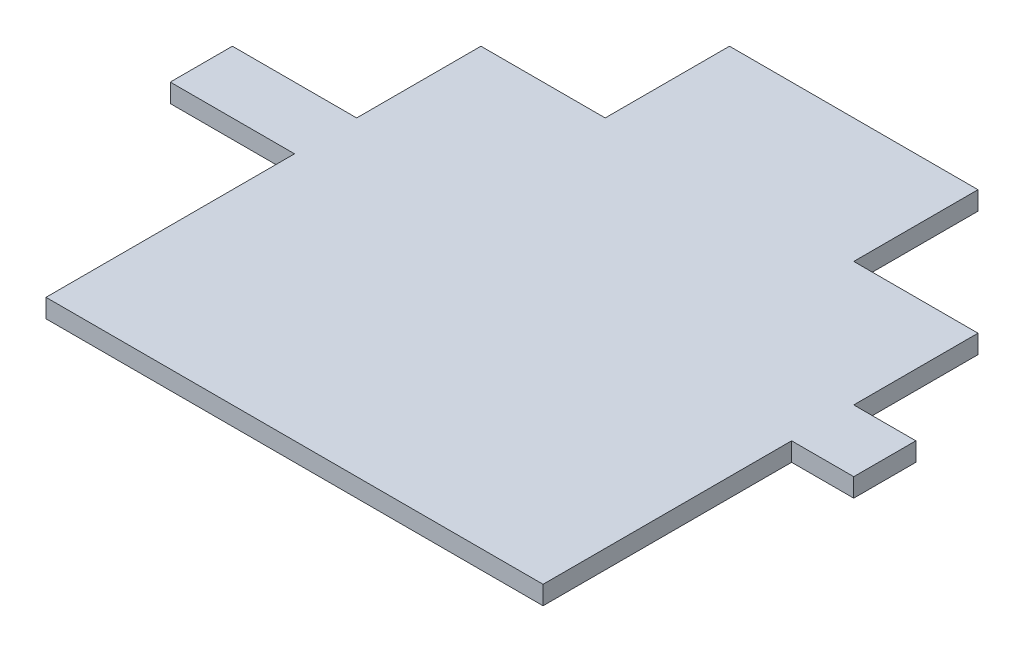
ISO-10303-21;
HEADER;
FILE_DESCRIPTION(('STEP AP214'),'2;1');
FILE_NAME('part.step','',(''),(''),'','','');
FILE_SCHEMA(('AUTOMOTIVE_DESIGN { 1 0 10303 214 1 1 1 1 }'));
ENDSEC;
DATA;
#1=APPLICATION_CONTEXT('core data for automotive mechanical design processes');
#2=APPLICATION_PROTOCOL_DEFINITION('international standard','automotive_design',2000,#1);
#3=PRODUCT_CONTEXT('',#1,'mechanical');
#4=PRODUCT('Part','Part','',(#3));
#5=PRODUCT_RELATED_PRODUCT_CATEGORY('part','',(#4));
#6=PRODUCT_DEFINITION_FORMATION('','',#4);
#7=PRODUCT_DEFINITION_CONTEXT('part definition',#1,'design');
#8=PRODUCT_DEFINITION('design','',#6,#7);
#9=PRODUCT_DEFINITION_SHAPE('','',#8);
#10=(LENGTH_UNIT() NAMED_UNIT(*) SI_UNIT(.MILLI.,.METRE.));
#11=(NAMED_UNIT(*) PLANE_ANGLE_UNIT() SI_UNIT($,.RADIAN.));
#12=(NAMED_UNIT(*) SI_UNIT($,.STERADIAN.) SOLID_ANGLE_UNIT());
#13=UNCERTAINTY_MEASURE_WITH_UNIT(LENGTH_MEASURE(1.E-05),#10,'distance_accuracy_value','');
#14=(GEOMETRIC_REPRESENTATION_CONTEXT(3) GLOBAL_UNCERTAINTY_ASSIGNED_CONTEXT((#13)) GLOBAL_UNIT_ASSIGNED_CONTEXT((#10,
#11,#12)) REPRESENTATION_CONTEXT('',''));
#15=CARTESIAN_POINT('',(0.,0.,0.));
#16=DIRECTION('',(0.,0.,1.));
#17=DIRECTION('',(1.,0.,0.));
#18=AXIS2_PLACEMENT_3D('',#15,#16,#17);
#19=CARTESIAN_POINT('',(-18.5650444594796,3.,12.794760036702));
#20=DIRECTION('',(1.,0.,0.));
#21=DIRECTION('',(0.,0.,-1.));
#22=AXIS2_PLACEMENT_3D('',#19,#20,#21);
#23=PLANE('',#22);
#24=DIRECTION('',(0.,0.,1.));
#25=VECTOR('',#24,1.);
#26=CARTESIAN_POINT('',(-18.5650444594796,0.,12.794760036702));
#27=LINE('',#26,#25);
#28=CARTESIAN_POINT('',(-18.5650444594796,0.,-7.20523996329803));
#29=VERTEX_POINT('',#28);
#30=CARTESIAN_POINT('',(-18.5650444594796,0.,12.794760036702));
#31=VERTEX_POINT('',#30);
#32=EDGE_CURVE('E177',#29,#31,#27,.T.);
#33=ORIENTED_EDGE('',*,*,#32,.T.);
#34=DIRECTION('',(0.,-1.,0.));
#35=VECTOR('',#34,1.);
#36=CARTESIAN_POINT('',(-18.5650444594796,3.,12.794760036702));
#37=LINE('',#36,#35);
#38=CARTESIAN_POINT('',(-18.5650444594796,3.,12.794760036702));
#39=VERTEX_POINT('',#38);
#40=EDGE_CURVE('E11',#39,#31,#37,.T.);
#41=ORIENTED_EDGE('',*,*,#40,.F.);
#42=DIRECTION('',(0.,0.,1.));
#43=VECTOR('',#42,1.);
#44=CARTESIAN_POINT('',(-18.5650444594796,3.,12.794760036702));
#45=LINE('',#44,#43);
#46=CARTESIAN_POINT('',(-18.5650444594796,3.,-7.20523996329803));
#47=VERTEX_POINT('',#46);
#48=EDGE_CURVE('E207',#47,#39,#45,.T.);
#49=ORIENTED_EDGE('',*,*,#48,.F.);
#50=DIRECTION('',(0.,-1.,0.));
#51=VECTOR('',#50,1.);
#52=CARTESIAN_POINT('',(-18.5650444594796,3.,-7.20523996329803));
#53=LINE('',#52,#51);
#54=EDGE_CURVE('E173',#47,#29,#53,.T.);
#55=ORIENTED_EDGE('',*,*,#54,.T.);
#56=EDGE_LOOP('',(#33,#41,#49,#55));
#57=FACE_BOUND('',#56,.T.);
#58=ADVANCED_FACE('F33',(#57),#23,.F.);
#59=CARTESIAN_POINT('',(-38.5650444594796,3.,12.794760036702));
#60=DIRECTION('',(0.,0.,1.));
#61=DIRECTION('',(1.,0.,0.));
#62=AXIS2_PLACEMENT_3D('',#59,#60,#61);
#63=PLANE('',#62);
#64=DIRECTION('',(-1.,0.,0.));
#65=VECTOR('',#64,1.);
#66=CARTESIAN_POINT('',(-38.5650444594796,0.,12.794760036702));
#67=LINE('',#66,#65);
#68=CARTESIAN_POINT('',(-38.5650444594796,0.,12.794760036702));
#69=VERTEX_POINT('',#68);
#70=EDGE_CURVE('E180',#31,#69,#67,.T.);
#71=ORIENTED_EDGE('',*,*,#70,.T.);
#72=DIRECTION('',(0.,-1.,0.));
#73=VECTOR('',#72,1.);
#74=CARTESIAN_POINT('',(-38.5650444594796,3.,12.794760036702));
#75=LINE('',#74,#73);
#76=CARTESIAN_POINT('',(-38.5650444594796,3.,12.794760036702));
#77=VERTEX_POINT('',#76);
#78=EDGE_CURVE('E41',#77,#69,#75,.T.);
#79=ORIENTED_EDGE('',*,*,#78,.F.);
#80=DIRECTION('',(-1.,0.,0.));
#81=VECTOR('',#80,1.);
#82=CARTESIAN_POINT('',(-38.5650444594796,3.,12.794760036702));
#83=LINE('',#82,#81);
#84=EDGE_CURVE('E116',#39,#77,#83,.T.);
#85=ORIENTED_EDGE('',*,*,#84,.F.);
#86=ORIENTED_EDGE('',*,*,#40,.T.);
#87=EDGE_LOOP('',(#71,#79,#85,#86));
#88=FACE_BOUND('',#87,.T.);
#89=ADVANCED_FACE('F305',(#88),#63,.F.);
#90=CARTESIAN_POINT('',(-38.5650444594796,3.,12.794760036702));
#91=DIRECTION('',(1.,0.,0.));
#92=DIRECTION('',(0.,0.,-1.));
#93=AXIS2_PLACEMENT_3D('',#90,#91,#92);
#94=PLANE('',#93);
#95=DIRECTION('',(0.,0.,1.));
#96=VECTOR('',#95,1.);
#97=CARTESIAN_POINT('',(-38.5650444594796,0.,12.794760036702));
#98=LINE('',#97,#96);
#99=CARTESIAN_POINT('',(-38.5650444594796,0.,32.794760036702));
#100=VERTEX_POINT('',#99);
#101=EDGE_CURVE('E182',#69,#100,#98,.T.);
#102=ORIENTED_EDGE('',*,*,#101,.T.);
#103=DIRECTION('',(0.,-1.,0.));
#104=VECTOR('',#103,1.);
#105=CARTESIAN_POINT('',(-38.5650444594796,3.,32.794760036702));
#106=LINE('',#105,#104);
#107=CARTESIAN_POINT('',(-38.5650444594796,3.,32.794760036702));
#108=VERTEX_POINT('',#107);
#109=EDGE_CURVE('E238',#108,#100,#106,.T.);
#110=ORIENTED_EDGE('',*,*,#109,.F.);
#111=DIRECTION('',(0.,0.,1.));
#112=VECTOR('',#111,1.);
#113=CARTESIAN_POINT('',(-38.5650444594796,3.,12.794760036702));
#114=LINE('',#113,#112);
#115=EDGE_CURVE('E246',#77,#108,#114,.T.);
#116=ORIENTED_EDGE('',*,*,#115,.F.);
#117=ORIENTED_EDGE('',*,*,#78,.T.);
#118=EDGE_LOOP('',(#102,#110,#116,#117));
#119=FACE_BOUND('',#118,.T.);
#120=ADVANCED_FACE('F244',(#119),#94,.F.);
#121=CARTESIAN_POINT('',(-38.5650444594796,3.,32.794760036702));
#122=DIRECTION('',(0.,0.,1.));
#123=DIRECTION('',(1.,0.,0.));
#124=AXIS2_PLACEMENT_3D('',#121,#122,#123);
#125=PLANE('',#124);
#126=DIRECTION('',(-1.,0.,0.));
#127=VECTOR('',#126,1.);
#128=CARTESIAN_POINT('',(-38.5650444594796,0.,32.794760036702));
#129=LINE('',#128,#127);
#130=CARTESIAN_POINT('',(-58.5650444594796,0.,32.794760036702));
#131=VERTEX_POINT('',#130);
#132=EDGE_CURVE('E184',#100,#131,#129,.T.);
#133=ORIENTED_EDGE('',*,*,#132,.T.);
#134=DIRECTION('',(0.,-1.,0.));
#135=VECTOR('',#134,1.);
#136=CARTESIAN_POINT('',(-58.5650444594796,3.,32.794760036702));
#137=LINE('',#136,#135);
#138=CARTESIAN_POINT('',(-58.5650444594796,3.,32.794760036702));
#139=VERTEX_POINT('',#138);
#140=EDGE_CURVE('E235',#139,#131,#137,.T.);
#141=ORIENTED_EDGE('',*,*,#140,.F.);
#142=DIRECTION('',(-1.,0.,0.));
#143=VECTOR('',#142,1.);
#144=CARTESIAN_POINT('',(-38.5650444594796,3.,32.794760036702));
#145=LINE('',#144,#143);
#146=EDGE_CURVE('E264',#108,#139,#145,.T.);
#147=ORIENTED_EDGE('',*,*,#146,.F.);
#148=ORIENTED_EDGE('',*,*,#109,.T.);
#149=EDGE_LOOP('',(#133,#141,#147,#148));
#150=FACE_BOUND('',#149,.T.);
#151=ADVANCED_FACE('F255',(#150),#125,.F.);
#152=CARTESIAN_POINT('',(-58.5650444594796,3.,32.794760036702));
#153=DIRECTION('',(1.,0.,0.));
#154=DIRECTION('',(0.,0.,-1.));
#155=AXIS2_PLACEMENT_3D('',#152,#153,#154);
#156=PLANE('',#155);
#157=DIRECTION('',(0.,0.,1.));
#158=VECTOR('',#157,1.);
#159=CARTESIAN_POINT('',(-58.5650444594796,0.,32.794760036702));
#160=LINE('',#159,#158);
#161=CARTESIAN_POINT('',(-58.5650444594796,0.,42.794760036702));
#162=VERTEX_POINT('',#161);
#163=EDGE_CURVE('E186',#131,#162,#160,.T.);
#164=ORIENTED_EDGE('',*,*,#163,.T.);
#165=DIRECTION('',(0.,-1.,0.));
#166=VECTOR('',#165,1.);
#167=CARTESIAN_POINT('',(-58.5650444594796,3.,42.794760036702));
#168=LINE('',#167,#166);
#169=CARTESIAN_POINT('',(-58.5650444594796,3.,42.794760036702));
#170=VERTEX_POINT('',#169);
#171=EDGE_CURVE('E232',#170,#162,#168,.T.);
#172=ORIENTED_EDGE('',*,*,#171,.F.);
#173=DIRECTION('',(0.,0.,1.));
#174=VECTOR('',#173,1.);
#175=CARTESIAN_POINT('',(-58.5650444594796,3.,32.794760036702));
#176=LINE('',#175,#174);
#177=EDGE_CURVE('E261',#139,#170,#176,.T.);
#178=ORIENTED_EDGE('',*,*,#177,.F.);
#179=ORIENTED_EDGE('',*,*,#140,.T.);
#180=EDGE_LOOP('',(#164,#172,#178,#179));
#181=FACE_BOUND('',#180,.T.);
#182=ADVANCED_FACE('F259',(#181),#156,.F.);
#183=CARTESIAN_POINT('',(-38.5650444594796,3.,42.794760036702));
#184=DIRECTION('',(0.,0.,-1.));
#185=DIRECTION('',(-1.,0.,0.));
#186=AXIS2_PLACEMENT_3D('',#183,#184,#185);
#187=PLANE('',#186);
#188=DIRECTION('',(1.,0.,0.));
#189=VECTOR('',#188,1.);
#190=CARTESIAN_POINT('',(-38.5650444594796,0.,42.794760036702));
#191=LINE('',#190,#189);
#192=CARTESIAN_POINT('',(-38.5650444594796,0.,42.794760036702));
#193=VERTEX_POINT('',#192);
#194=EDGE_CURVE('E188',#162,#193,#191,.T.);
#195=ORIENTED_EDGE('',*,*,#194,.T.);
#196=DIRECTION('',(0.,-1.,0.));
#197=VECTOR('',#196,1.);
#198=CARTESIAN_POINT('',(-38.5650444594796,3.,42.794760036702));
#199=LINE('',#198,#197);
#200=CARTESIAN_POINT('',(-38.5650444594796,3.,42.794760036702));
#201=VERTEX_POINT('',#200);
#202=EDGE_CURVE('E229',#201,#193,#199,.T.);
#203=ORIENTED_EDGE('',*,*,#202,.F.);
#204=DIRECTION('',(1.,0.,0.));
#205=VECTOR('',#204,1.);
#206=CARTESIAN_POINT('',(-38.5650444594796,3.,42.794760036702));
#207=LINE('',#206,#205);
#208=EDGE_CURVE('E263',#170,#201,#207,.T.);
#209=ORIENTED_EDGE('',*,*,#208,.F.);
#210=ORIENTED_EDGE('',*,*,#171,.T.);
#211=EDGE_LOOP('',(#195,#203,#209,#210));
#212=FACE_BOUND('',#211,.T.);
#213=ADVANCED_FACE('F318',(#212),#187,.F.);
#214=CARTESIAN_POINT('',(-38.5650444594796,3.,42.794760036702));
#215=DIRECTION('',(1.,0.,0.));
#216=DIRECTION('',(0.,0.,-1.));
#217=AXIS2_PLACEMENT_3D('',#214,#215,#216);
#218=PLANE('',#217);
#219=DIRECTION('',(0.,0.,1.));
#220=VECTOR('',#219,1.);
#221=CARTESIAN_POINT('',(-38.5650444594796,0.,42.794760036702));
#222=LINE('',#221,#220);
#223=CARTESIAN_POINT('',(-38.5650444594796,0.,82.794760036702));
#224=VERTEX_POINT('',#223);
#225=EDGE_CURVE('E190',#193,#224,#222,.T.);
#226=ORIENTED_EDGE('',*,*,#225,.T.);
#227=DIRECTION('',(0.,-1.,0.));
#228=VECTOR('',#227,1.);
#229=CARTESIAN_POINT('',(-38.5650444594796,3.,82.794760036702));
#230=LINE('',#229,#228);
#231=CARTESIAN_POINT('',(-38.5650444594796,3.,82.794760036702));
#232=VERTEX_POINT('',#231);
#233=EDGE_CURVE('E226',#232,#224,#230,.T.);
#234=ORIENTED_EDGE('',*,*,#233,.F.);
#235=DIRECTION('',(0.,0.,1.));
#236=VECTOR('',#235,1.);
#237=CARTESIAN_POINT('',(-38.5650444594796,3.,42.794760036702));
#238=LINE('',#237,#236);
#239=EDGE_CURVE('E266',#201,#232,#238,.T.);
#240=ORIENTED_EDGE('',*,*,#239,.F.);
#241=ORIENTED_EDGE('',*,*,#202,.T.);
#242=EDGE_LOOP('',(#226,#234,#240,#241));
#243=FACE_BOUND('',#242,.T.);
#244=ADVANCED_FACE('F321',(#243),#218,.F.);
#245=CARTESIAN_POINT('',(-38.5650444594796,3.,82.794760036702));
#246=DIRECTION('',(0.,0.,-1.));
#247=DIRECTION('',(-1.,0.,0.));
#248=AXIS2_PLACEMENT_3D('',#245,#246,#247);
#249=PLANE('',#248);
#250=DIRECTION('',(1.,0.,0.));
#251=VECTOR('',#250,1.);
#252=CARTESIAN_POINT('',(-38.5650444594796,0.,82.794760036702));
#253=LINE('',#252,#251);
#254=CARTESIAN_POINT('',(41.4349555405204,0.,82.794760036702));
#255=VERTEX_POINT('',#254);
#256=EDGE_CURVE('E192',#224,#255,#253,.T.);
#257=ORIENTED_EDGE('',*,*,#256,.T.);
#258=DIRECTION('',(0.,-1.,0.));
#259=VECTOR('',#258,1.);
#260=CARTESIAN_POINT('',(41.4349555405204,3.,82.794760036702));
#261=LINE('',#260,#259);
#262=CARTESIAN_POINT('',(41.4349555405204,3.,82.794760036702));
#263=VERTEX_POINT('',#262);
#264=EDGE_CURVE('E223',#263,#255,#261,.T.);
#265=ORIENTED_EDGE('',*,*,#264,.F.);
#266=DIRECTION('',(1.,0.,0.));
#267=VECTOR('',#266,1.);
#268=CARTESIAN_POINT('',(-38.5650444594796,3.,82.794760036702));
#269=LINE('',#268,#267);
#270=EDGE_CURVE('E272',#232,#263,#269,.T.);
#271=ORIENTED_EDGE('',*,*,#270,.F.);
#272=ORIENTED_EDGE('',*,*,#233,.T.);
#273=EDGE_LOOP('',(#257,#265,#271,#272));
#274=FACE_BOUND('',#273,.T.);
#275=ADVANCED_FACE('F325',(#274),#249,.F.);
#276=CARTESIAN_POINT('',(41.4349555405204,3.,42.794760036702));
#277=DIRECTION('',(-1.,0.,0.));
#278=DIRECTION('',(0.,0.,1.));
#279=AXIS2_PLACEMENT_3D('',#276,#277,#278);
#280=PLANE('',#279);
#281=DIRECTION('',(0.,0.,-1.));
#282=VECTOR('',#281,1.);
#283=CARTESIAN_POINT('',(41.4349555405204,0.,42.794760036702));
#284=LINE('',#283,#282);
#285=CARTESIAN_POINT('',(41.4349555405204,0.,42.794760036702));
#286=VERTEX_POINT('',#285);
#287=EDGE_CURVE('E194',#255,#286,#284,.T.);
#288=ORIENTED_EDGE('',*,*,#287,.T.);
#289=DIRECTION('',(0.,-1.,0.));
#290=VECTOR('',#289,1.);
#291=CARTESIAN_POINT('',(41.4349555405204,3.,42.794760036702));
#292=LINE('',#291,#290);
#293=CARTESIAN_POINT('',(41.4349555405204,3.,42.794760036702));
#294=VERTEX_POINT('',#293);
#295=EDGE_CURVE('E220',#294,#286,#292,.T.);
#296=ORIENTED_EDGE('',*,*,#295,.F.);
#297=DIRECTION('',(0.,0.,-1.));
#298=VECTOR('',#297,1.);
#299=CARTESIAN_POINT('',(41.4349555405204,3.,42.794760036702));
#300=LINE('',#299,#298);
#301=EDGE_CURVE('E274',#263,#294,#300,.T.);
#302=ORIENTED_EDGE('',*,*,#301,.F.);
#303=ORIENTED_EDGE('',*,*,#264,.T.);
#304=EDGE_LOOP('',(#288,#296,#302,#303));
#305=FACE_BOUND('',#304,.T.);
#306=ADVANCED_FACE('F329',(#305),#280,.F.);
#307=CARTESIAN_POINT('',(41.4349555405204,3.,42.794760036702));
#308=DIRECTION('',(0.,0.,-1.));
#309=DIRECTION('',(-1.,0.,0.));
#310=AXIS2_PLACEMENT_3D('',#307,#308,#309);
#311=PLANE('',#310);
#312=DIRECTION('',(1.,0.,0.));
#313=VECTOR('',#312,1.);
#314=CARTESIAN_POINT('',(41.4349555405204,0.,42.794760036702));
#315=LINE('',#314,#313);
#316=CARTESIAN_POINT('',(51.4349555405204,0.,42.794760036702));
#317=VERTEX_POINT('',#316);
#318=EDGE_CURVE('E196',#286,#317,#315,.T.);
#319=ORIENTED_EDGE('',*,*,#318,.T.);
#320=DIRECTION('',(0.,-1.,0.));
#321=VECTOR('',#320,1.);
#322=CARTESIAN_POINT('',(51.4349555405204,3.,42.794760036702));
#323=LINE('',#322,#321);
#324=CARTESIAN_POINT('',(51.4349555405204,3.,42.794760036702));
#325=VERTEX_POINT('',#324);
#326=EDGE_CURVE('E217',#325,#317,#323,.T.);
#327=ORIENTED_EDGE('',*,*,#326,.F.);
#328=DIRECTION('',(1.,0.,0.));
#329=VECTOR('',#328,1.);
#330=CARTESIAN_POINT('',(41.4349555405204,3.,42.794760036702));
#331=LINE('',#330,#329);
#332=EDGE_CURVE('E276',#294,#325,#331,.T.);
#333=ORIENTED_EDGE('',*,*,#332,.F.);
#334=ORIENTED_EDGE('',*,*,#295,.T.);
#335=EDGE_LOOP('',(#319,#327,#333,#334));
#336=FACE_BOUND('',#335,.T.);
#337=ADVANCED_FACE('F333',(#336),#311,.F.);
#338=CARTESIAN_POINT('',(51.4349555405204,3.,32.794760036702));
#339=DIRECTION('',(-1.,0.,0.));
#340=DIRECTION('',(0.,0.,1.));
#341=AXIS2_PLACEMENT_3D('',#338,#339,#340);
#342=PLANE('',#341);
#343=DIRECTION('',(0.,0.,-1.));
#344=VECTOR('',#343,1.);
#345=CARTESIAN_POINT('',(51.4349555405204,0.,32.794760036702));
#346=LINE('',#345,#344);
#347=CARTESIAN_POINT('',(51.4349555405204,0.,32.794760036702));
#348=VERTEX_POINT('',#347);
#349=EDGE_CURVE('E198',#317,#348,#346,.T.);
#350=ORIENTED_EDGE('',*,*,#349,.T.);
#351=DIRECTION('',(0.,-1.,0.));
#352=VECTOR('',#351,1.);
#353=CARTESIAN_POINT('',(51.4349555405204,3.,32.794760036702));
#354=LINE('',#353,#352);
#355=CARTESIAN_POINT('',(51.4349555405204,3.,32.794760036702));
#356=VERTEX_POINT('',#355);
#357=EDGE_CURVE('E214',#356,#348,#354,.T.);
#358=ORIENTED_EDGE('',*,*,#357,.F.);
#359=DIRECTION('',(0.,0.,-1.));
#360=VECTOR('',#359,1.);
#361=CARTESIAN_POINT('',(51.4349555405204,3.,32.794760036702));
#362=LINE('',#361,#360);
#363=EDGE_CURVE('E278',#325,#356,#362,.T.);
#364=ORIENTED_EDGE('',*,*,#363,.F.);
#365=ORIENTED_EDGE('',*,*,#326,.T.);
#366=EDGE_LOOP('',(#350,#358,#364,#365));
#367=FACE_BOUND('',#366,.T.);
#368=ADVANCED_FACE('F337',(#367),#342,.F.);
#369=CARTESIAN_POINT('',(41.4349555405204,3.,32.794760036702));
#370=DIRECTION('',(0.,0.,1.));
#371=DIRECTION('',(1.,0.,0.));
#372=AXIS2_PLACEMENT_3D('',#369,#370,#371);
#373=PLANE('',#372);
#374=DIRECTION('',(-1.,0.,0.));
#375=VECTOR('',#374,1.);
#376=CARTESIAN_POINT('',(41.4349555405204,0.,32.794760036702));
#377=LINE('',#376,#375);
#378=CARTESIAN_POINT('',(41.4349555405204,0.,32.794760036702));
#379=VERTEX_POINT('',#378);
#380=EDGE_CURVE('E200',#348,#379,#377,.T.);
#381=ORIENTED_EDGE('',*,*,#380,.T.);
#382=DIRECTION('',(0.,-1.,0.));
#383=VECTOR('',#382,1.);
#384=CARTESIAN_POINT('',(41.4349555405204,3.,32.794760036702));
#385=LINE('',#384,#383);
#386=CARTESIAN_POINT('',(41.4349555405204,3.,32.794760036702));
#387=VERTEX_POINT('',#386);
#388=EDGE_CURVE('E211',#387,#379,#385,.T.);
#389=ORIENTED_EDGE('',*,*,#388,.F.);
#390=DIRECTION('',(-1.,0.,0.));
#391=VECTOR('',#390,1.);
#392=CARTESIAN_POINT('',(41.4349555405204,3.,32.794760036702));
#393=LINE('',#392,#391);
#394=EDGE_CURVE('E280',#356,#387,#393,.T.);
#395=ORIENTED_EDGE('',*,*,#394,.F.);
#396=ORIENTED_EDGE('',*,*,#357,.T.);
#397=EDGE_LOOP('',(#381,#389,#395,#396));
#398=FACE_BOUND('',#397,.T.);
#399=ADVANCED_FACE('F286',(#398),#373,.F.);
#400=CARTESIAN_POINT('',(41.4349555405204,3.,12.794760036702));
#401=DIRECTION('',(-1.,0.,0.));
#402=DIRECTION('',(0.,0.,1.));
#403=AXIS2_PLACEMENT_3D('',#400,#401,#402);
#404=PLANE('',#403);
#405=DIRECTION('',(0.,0.,-1.));
#406=VECTOR('',#405,1.);
#407=CARTESIAN_POINT('',(41.4349555405204,0.,12.794760036702));
#408=LINE('',#407,#406);
#409=CARTESIAN_POINT('',(41.4349555405204,0.,12.794760036702));
#410=VERTEX_POINT('',#409);
#411=EDGE_CURVE('E202',#379,#410,#408,.T.);
#412=ORIENTED_EDGE('',*,*,#411,.T.);
#413=DIRECTION('',(0.,-1.,0.));
#414=VECTOR('',#413,1.);
#415=CARTESIAN_POINT('',(41.4349555405204,3.,12.794760036702));
#416=LINE('',#415,#414);
#417=CARTESIAN_POINT('',(41.4349555405204,3.,12.794760036702));
#418=VERTEX_POINT('',#417);
#419=EDGE_CURVE('E168',#418,#410,#416,.T.);
#420=ORIENTED_EDGE('',*,*,#419,.F.);
#421=DIRECTION('',(0.,0.,-1.));
#422=VECTOR('',#421,1.);
#423=CARTESIAN_POINT('',(41.4349555405204,3.,12.794760036702));
#424=LINE('',#423,#422);
#425=EDGE_CURVE('E159',#387,#418,#424,.T.);
#426=ORIENTED_EDGE('',*,*,#425,.F.);
#427=ORIENTED_EDGE('',*,*,#388,.T.);
#428=EDGE_LOOP('',(#412,#420,#426,#427));
#429=FACE_BOUND('',#428,.T.);
#430=ADVANCED_FACE('F290',(#429),#404,.F.);
#431=CARTESIAN_POINT('',(21.4349555405204,3.,12.794760036702));
#432=DIRECTION('',(0.,0.,1.));
#433=DIRECTION('',(1.,0.,0.));
#434=AXIS2_PLACEMENT_3D('',#431,#432,#433);
#435=PLANE('',#434);
#436=DIRECTION('',(-1.,0.,0.));
#437=VECTOR('',#436,1.);
#438=CARTESIAN_POINT('',(21.4349555405204,0.,12.794760036702));
#439=LINE('',#438,#437);
#440=CARTESIAN_POINT('',(21.4349555405204,0.,12.794760036702));
#441=VERTEX_POINT('',#440);
#442=EDGE_CURVE('E167',#410,#441,#439,.T.);
#443=ORIENTED_EDGE('',*,*,#442,.T.);
#444=DIRECTION('',(0.,-1.,0.));
#445=VECTOR('',#444,1.);
#446=CARTESIAN_POINT('',(21.4349555405204,3.,12.794760036702));
#447=LINE('',#446,#445);
#448=CARTESIAN_POINT('',(21.4349555405204,3.,12.794760036702));
#449=VERTEX_POINT('',#448);
#450=EDGE_CURVE('E164',#449,#441,#447,.T.);
#451=ORIENTED_EDGE('',*,*,#450,.F.);
#452=DIRECTION('',(-1.,0.,0.));
#453=VECTOR('',#452,1.);
#454=CARTESIAN_POINT('',(21.4349555405204,3.,12.794760036702));
#455=LINE('',#454,#453);
#456=EDGE_CURVE('E153',#418,#449,#455,.T.);
#457=ORIENTED_EDGE('',*,*,#456,.F.);
#458=ORIENTED_EDGE('',*,*,#419,.T.);
#459=EDGE_LOOP('',(#443,#451,#457,#458));
#460=FACE_BOUND('',#459,.T.);
#461=ADVANCED_FACE('F165',(#460),#435,.F.);
#462=CARTESIAN_POINT('',(21.4349555405204,3.,12.794760036702));
#463=DIRECTION('',(-1.,0.,0.));
#464=DIRECTION('',(0.,0.,1.));
#465=AXIS2_PLACEMENT_3D('',#462,#463,#464);
#466=PLANE('',#465);
#467=DIRECTION('',(0.,0.,-1.));
#468=VECTOR('',#467,1.);
#469=CARTESIAN_POINT('',(21.4349555405204,0.,12.794760036702));
#470=LINE('',#469,#468);
#471=CARTESIAN_POINT('',(21.4349555405204,0.,-7.20523996329803));
#472=VERTEX_POINT('',#471);
#473=EDGE_CURVE('E102',#441,#472,#470,.T.);
#474=ORIENTED_EDGE('',*,*,#473,.T.);
#475=DIRECTION('',(0.,-1.,0.));
#476=VECTOR('',#475,1.);
#477=CARTESIAN_POINT('',(21.4349555405204,3.,-7.20523996329803));
#478=LINE('',#477,#476);
#479=CARTESIAN_POINT('',(21.4349555405204,3.,-7.20523996329803));
#480=VERTEX_POINT('',#479);
#481=EDGE_CURVE('E169',#480,#472,#478,.T.);
#482=ORIENTED_EDGE('',*,*,#481,.F.);
#483=DIRECTION('',(0.,0.,-1.));
#484=VECTOR('',#483,1.);
#485=CARTESIAN_POINT('',(21.4349555405204,3.,12.794760036702));
#486=LINE('',#485,#484);
#487=EDGE_CURVE('E157',#449,#480,#486,.T.);
#488=ORIENTED_EDGE('',*,*,#487,.F.);
#489=ORIENTED_EDGE('',*,*,#450,.T.);
#490=EDGE_LOOP('',(#474,#482,#488,#489));
#491=FACE_BOUND('',#490,.T.);
#492=ADVANCED_FACE('F171',(#491),#466,.F.);
#493=CARTESIAN_POINT('',(-18.5650444594796,3.,-7.20523996329803));
#494=DIRECTION('',(0.,0.,1.));
#495=DIRECTION('',(1.,0.,0.));
#496=AXIS2_PLACEMENT_3D('',#493,#494,#495);
#497=PLANE('',#496);
#498=DIRECTION('',(-1.,0.,0.));
#499=VECTOR('',#498,1.);
#500=CARTESIAN_POINT('',(-18.5650444594796,0.,-7.20523996329803));
#501=LINE('',#500,#499);
#502=EDGE_CURVE('E108',#472,#29,#501,.T.);
#503=ORIENTED_EDGE('',*,*,#502,.T.);
#504=ORIENTED_EDGE('',*,*,#54,.F.);
#505=DIRECTION('',(-1.,0.,0.));
#506=VECTOR('',#505,1.);
#507=CARTESIAN_POINT('',(-18.5650444594796,3.,-7.20523996329803));
#508=LINE('',#507,#506);
#509=EDGE_CURVE('E49',#480,#47,#508,.T.);
#510=ORIENTED_EDGE('',*,*,#509,.F.);
#511=ORIENTED_EDGE('',*,*,#481,.T.);
#512=EDGE_LOOP('',(#503,#504,#510,#511));
#513=FACE_BOUND('',#512,.T.);
#514=ADVANCED_FACE('F294',(#513),#497,.F.);
#515=CARTESIAN_POINT('',(0.,3.,0.));
#516=DIRECTION('',(0.,-1.,0.));
#517=DIRECTION('',(0.,0.,-1.));
#518=AXIS2_PLACEMENT_3D('',#515,#516,#517);
#519=PLANE('',#518);
#520=ORIENTED_EDGE('',*,*,#48,.T.);
#521=ORIENTED_EDGE('',*,*,#84,.T.);
#522=ORIENTED_EDGE('',*,*,#115,.T.);
#523=ORIENTED_EDGE('',*,*,#146,.T.);
#524=ORIENTED_EDGE('',*,*,#177,.T.);
#525=ORIENTED_EDGE('',*,*,#208,.T.);
#526=ORIENTED_EDGE('',*,*,#239,.T.);
#527=ORIENTED_EDGE('',*,*,#270,.T.);
#528=ORIENTED_EDGE('',*,*,#301,.T.);
#529=ORIENTED_EDGE('',*,*,#332,.T.);
#530=ORIENTED_EDGE('',*,*,#363,.T.);
#531=ORIENTED_EDGE('',*,*,#394,.T.);
#532=ORIENTED_EDGE('',*,*,#425,.T.);
#533=ORIENTED_EDGE('',*,*,#456,.T.);
#534=ORIENTED_EDGE('',*,*,#487,.T.);
#535=ORIENTED_EDGE('',*,*,#509,.T.);
#536=EDGE_LOOP('',(#520,#521,#522,#523,#524,#525,#526,#527,#528,#529,#530,#531,#532,#533,#534,#535));
#537=FACE_BOUND('',#536,.T.);
#538=ADVANCED_FACE('F155',(#537),#519,.F.);
#539=CARTESIAN_POINT('',(0.,0.,0.));
#540=DIRECTION('',(0.,-1.,0.));
#541=DIRECTION('',(0.,0.,-1.));
#542=AXIS2_PLACEMENT_3D('',#539,#540,#541);
#543=PLANE('',#542);
#544=ORIENTED_EDGE('',*,*,#32,.F.);
#545=ORIENTED_EDGE('',*,*,#502,.F.);
#546=ORIENTED_EDGE('',*,*,#473,.F.);
#547=ORIENTED_EDGE('',*,*,#442,.F.);
#548=ORIENTED_EDGE('',*,*,#411,.F.);
#549=ORIENTED_EDGE('',*,*,#380,.F.);
#550=ORIENTED_EDGE('',*,*,#349,.F.);
#551=ORIENTED_EDGE('',*,*,#318,.F.);
#552=ORIENTED_EDGE('',*,*,#287,.F.);
#553=ORIENTED_EDGE('',*,*,#256,.F.);
#554=ORIENTED_EDGE('',*,*,#225,.F.);
#555=ORIENTED_EDGE('',*,*,#194,.F.);
#556=ORIENTED_EDGE('',*,*,#163,.F.);
#557=ORIENTED_EDGE('',*,*,#132,.F.);
#558=ORIENTED_EDGE('',*,*,#101,.F.);
#559=ORIENTED_EDGE('',*,*,#70,.F.);
#560=EDGE_LOOP('',(#544,#545,#546,#547,#548,#549,#550,#551,#552,#553,#554,#555,#556,#557,#558,#559));
#561=FACE_BOUND('',#560,.T.);
#562=ADVANCED_FACE('F250',(#561),#543,.T.);
#563=CLOSED_SHELL('',(#58,#89,#120,#151,#182,#213,#244,#275,#306,#337,#368,#399,#430,#461,#492,
#514,#538,#562));
#564=MANIFOLD_SOLID_BREP('B2',#563);
#565=ADVANCED_BREP_SHAPE_REPRESENTATION('',(#18,#564),#14);
#566=SHAPE_DEFINITION_REPRESENTATION(#9,#565);
ENDSEC;
END-ISO-10303-21;
